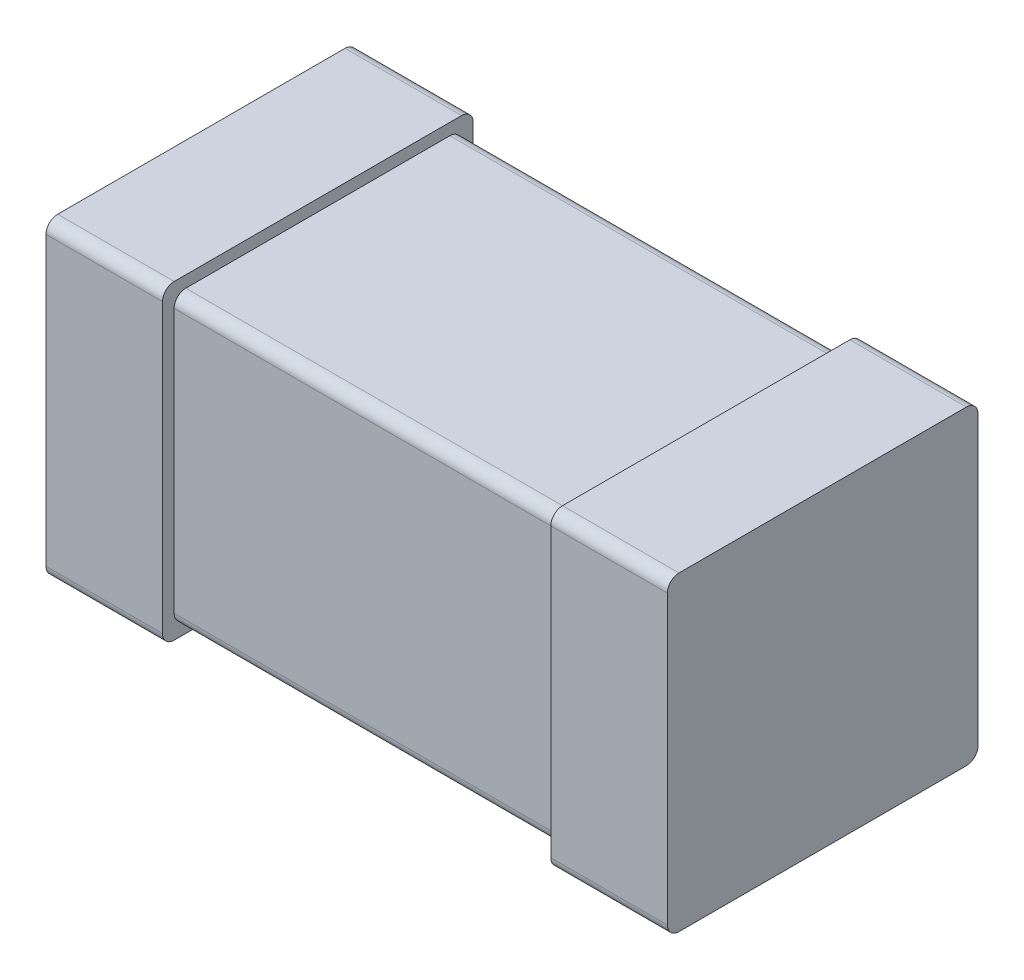
ISO-10303-21;
HEADER;
FILE_DESCRIPTION(('STEP AP214'),'2;1');
FILE_NAME('part.step','',(''),(''),'','','');
FILE_SCHEMA(('AUTOMOTIVE_DESIGN { 1 0 10303 214 1 1 1 1 }'));
ENDSEC;
DATA;
#1=APPLICATION_CONTEXT('core data for automotive mechanical design processes');
#2=APPLICATION_PROTOCOL_DEFINITION('international standard','automotive_design',2000,#1);
#3=PRODUCT_CONTEXT('',#1,'mechanical');
#4=PRODUCT('Part','Part','',(#3));
#5=PRODUCT_RELATED_PRODUCT_CATEGORY('part','',(#4));
#6=PRODUCT_DEFINITION_FORMATION('','',#4);
#7=PRODUCT_DEFINITION_CONTEXT('part definition',#1,'design');
#8=PRODUCT_DEFINITION('design','',#6,#7);
#9=PRODUCT_DEFINITION_SHAPE('','',#8);
#10=(LENGTH_UNIT() NAMED_UNIT(*) SI_UNIT(.MILLI.,.METRE.));
#11=(NAMED_UNIT(*) PLANE_ANGLE_UNIT() SI_UNIT($,.RADIAN.));
#12=(NAMED_UNIT(*) SI_UNIT($,.STERADIAN.) SOLID_ANGLE_UNIT());
#13=UNCERTAINTY_MEASURE_WITH_UNIT(LENGTH_MEASURE(1.E-05),#10,'distance_accuracy_value','');
#14=(GEOMETRIC_REPRESENTATION_CONTEXT(3) GLOBAL_UNCERTAINTY_ASSIGNED_CONTEXT((#13)) GLOBAL_UNIT_ASSIGNED_CONTEXT((#10,
#11,#12)) REPRESENTATION_CONTEXT('',''));
#15=CARTESIAN_POINT('',(0.,0.,0.));
#16=DIRECTION('',(0.,0.,1.));
#17=DIRECTION('',(1.,0.,0.));
#18=AXIS2_PLACEMENT_3D('',#15,#16,#17);
#19=CARTESIAN_POINT('',(-0.8,0.4,0.));
#20=DIRECTION('',(1.,0.,0.));
#21=DIRECTION('',(0.,0.,1.));
#22=AXIS2_PLACEMENT_3D('',#19,#20,#21);
#23=PLANE('',#22);
#24=DIRECTION('',(0.,-1.,0.));
#25=VECTOR('',#24,1.);
#26=CARTESIAN_POINT('',(-0.8,0.,0.8));
#27=LINE('',#26,#25);
#28=CARTESIAN_POINT('',(-0.8,0.37,0.8));
#29=VERTEX_POINT('',#28);
#30=CARTESIAN_POINT('',(-0.8,-0.37,0.8));
#31=VERTEX_POINT('',#30);
#32=EDGE_CURVE('E301',#29,#31,#27,.T.);
#33=ORIENTED_EDGE('',*,*,#32,.F.);
#34=CARTESIAN_POINT('',(-0.8,0.37,0.77));
#35=DIRECTION('',(1.,0.,0.));
#36=DIRECTION('',(0.,0.,-1.));
#37=AXIS2_PLACEMENT_3D('',#34,#35,#36);
#38=CIRCLE('',#37,0.0300000000000011);
#39=CARTESIAN_POINT('',(-0.8,0.4,0.77));
#40=VERTEX_POINT('',#39);
#41=EDGE_CURVE('E280',#40,#29,#38,.T.);
#42=ORIENTED_EDGE('',*,*,#41,.F.);
#43=DIRECTION('',(0.,0.,1.));
#44=VECTOR('',#43,1.);
#45=CARTESIAN_POINT('',(-0.8,0.4,0.4));
#46=LINE('',#45,#44);
#47=CARTESIAN_POINT('',(-0.8,0.4,0.03));
#48=VERTEX_POINT('',#47);
#49=EDGE_CURVE('E202',#48,#40,#46,.T.);
#50=ORIENTED_EDGE('',*,*,#49,.F.);
#51=CARTESIAN_POINT('',(-0.8,0.37,0.03));
#52=DIRECTION('',(1.,0.,0.));
#53=DIRECTION('',(0.,0.,-1.));
#54=AXIS2_PLACEMENT_3D('',#51,#52,#53);
#55=CIRCLE('',#54,0.0300000000000011);
#56=CARTESIAN_POINT('',(-0.8,0.37,0.));
#57=VERTEX_POINT('',#56);
#58=EDGE_CURVE('E197',#57,#48,#55,.T.);
#59=ORIENTED_EDGE('',*,*,#58,.F.);
#60=DIRECTION('',(0.,-1.,0.));
#61=VECTOR('',#60,1.);
#62=CARTESIAN_POINT('',(-0.8,0.,0.));
#63=LINE('',#62,#61);
#64=CARTESIAN_POINT('',(-0.8,-0.37,0.));
#65=VERTEX_POINT('',#64);
#66=EDGE_CURVE('E189',#57,#65,#63,.T.);
#67=ORIENTED_EDGE('',*,*,#66,.T.);
#68=CARTESIAN_POINT('',(-0.8,-0.37,0.03));
#69=DIRECTION('',(1.,0.,0.));
#70=DIRECTION('',(0.,0.,-1.));
#71=AXIS2_PLACEMENT_3D('',#68,#69,#70);
#72=CIRCLE('',#71,0.0300000000000011);
#73=CARTESIAN_POINT('',(-0.8,-0.4,0.03));
#74=VERTEX_POINT('',#73);
#75=EDGE_CURVE('E21',#74,#65,#72,.T.);
#76=ORIENTED_EDGE('',*,*,#75,.F.);
#77=DIRECTION('',(0.,0.,1.));
#78=VECTOR('',#77,1.);
#79=CARTESIAN_POINT('',(-0.8,-0.4,0.4));
#80=LINE('',#79,#78);
#81=CARTESIAN_POINT('',(-0.8,-0.4,0.77));
#82=VERTEX_POINT('',#81);
#83=EDGE_CURVE('E172',#74,#82,#80,.T.);
#84=ORIENTED_EDGE('',*,*,#83,.T.);
#85=CARTESIAN_POINT('',(-0.8,-0.37,0.77));
#86=DIRECTION('',(1.,0.,0.));
#87=DIRECTION('',(0.,0.,-1.));
#88=AXIS2_PLACEMENT_3D('',#85,#86,#87);
#89=CIRCLE('',#88,0.0300000000000011);
#90=EDGE_CURVE('E276',#31,#82,#89,.T.);
#91=ORIENTED_EDGE('',*,*,#90,.F.);
#92=EDGE_LOOP('',(#33,#42,#50,#59,#67,#76,#84,#91));
#93=FACE_BOUND('',#92,.T.);
#94=ADVANCED_FACE('F17',(#93),#23,.F.);
#95=CARTESIAN_POINT('',(0.8,0.4,0.));
#96=DIRECTION('',(1.,0.,0.));
#97=DIRECTION('',(0.,0.,1.));
#98=AXIS2_PLACEMENT_3D('',#95,#96,#97);
#99=PLANE('',#98);
#100=DIRECTION('',(0.,1.,0.));
#101=VECTOR('',#100,1.);
#102=CARTESIAN_POINT('',(0.8,0.,0.8));
#103=LINE('',#102,#101);
#104=CARTESIAN_POINT('',(0.8,-0.37,0.8));
#105=VERTEX_POINT('',#104);
#106=CARTESIAN_POINT('',(0.8,0.37,0.8));
#107=VERTEX_POINT('',#106);
#108=EDGE_CURVE('E291',#105,#107,#103,.T.);
#109=ORIENTED_EDGE('',*,*,#108,.F.);
#110=CARTESIAN_POINT('',(0.8,-0.37,0.77));
#111=DIRECTION('',(1.,0.,0.));
#112=DIRECTION('',(0.,0.,-1.));
#113=AXIS2_PLACEMENT_3D('',#110,#111,#112);
#114=CIRCLE('',#113,0.0300000000000011);
#115=CARTESIAN_POINT('',(0.8,-0.4,0.77));
#116=VERTEX_POINT('',#115);
#117=EDGE_CURVE('E260',#116,#105,#114,.F.);
#118=ORIENTED_EDGE('',*,*,#117,.F.);
#119=DIRECTION('',(0.,0.,-1.));
#120=VECTOR('',#119,1.);
#121=CARTESIAN_POINT('',(0.8,-0.4,0.4));
#122=LINE('',#121,#120);
#123=CARTESIAN_POINT('',(0.8,-0.4,0.03));
#124=VERTEX_POINT('',#123);
#125=EDGE_CURVE('E275',#116,#124,#122,.T.);
#126=ORIENTED_EDGE('',*,*,#125,.T.);
#127=CARTESIAN_POINT('',(0.8,-0.37,0.03));
#128=DIRECTION('',(1.,0.,0.));
#129=DIRECTION('',(0.,0.,-1.));
#130=AXIS2_PLACEMENT_3D('',#127,#128,#129);
#131=CIRCLE('',#130,0.0300000000000011);
#132=CARTESIAN_POINT('',(0.8,-0.37,0.));
#133=VERTEX_POINT('',#132);
#134=EDGE_CURVE('E272',#133,#124,#131,.F.);
#135=ORIENTED_EDGE('',*,*,#134,.F.);
#136=DIRECTION('',(0.,1.,0.));
#137=VECTOR('',#136,1.);
#138=CARTESIAN_POINT('',(0.8,0.,0.));
#139=LINE('',#138,#137);
#140=CARTESIAN_POINT('',(0.8,0.37,0.));
#141=VERTEX_POINT('',#140);
#142=EDGE_CURVE('E271',#133,#141,#139,.T.);
#143=ORIENTED_EDGE('',*,*,#142,.T.);
#144=CARTESIAN_POINT('',(0.8,0.37,0.03));
#145=DIRECTION('',(1.,0.,0.));
#146=DIRECTION('',(0.,0.,-1.));
#147=AXIS2_PLACEMENT_3D('',#144,#145,#146);
#148=CIRCLE('',#147,0.0300000000000011);
#149=CARTESIAN_POINT('',(0.8,0.4,0.03));
#150=VERTEX_POINT('',#149);
#151=EDGE_CURVE('E268',#150,#141,#148,.F.);
#152=ORIENTED_EDGE('',*,*,#151,.F.);
#153=DIRECTION('',(0.,0.,-1.));
#154=VECTOR('',#153,1.);
#155=CARTESIAN_POINT('',(0.8,0.4,0.4));
#156=LINE('',#155,#154);
#157=CARTESIAN_POINT('',(0.8,0.4,0.77));
#158=VERTEX_POINT('',#157);
#159=EDGE_CURVE('E296',#158,#150,#156,.T.);
#160=ORIENTED_EDGE('',*,*,#159,.F.);
#161=CARTESIAN_POINT('',(0.8,0.37,0.77));
#162=DIRECTION('',(1.,0.,0.));
#163=DIRECTION('',(0.,0.,-1.));
#164=AXIS2_PLACEMENT_3D('',#161,#162,#163);
#165=CIRCLE('',#164,0.0300000000000011);
#166=EDGE_CURVE('E264',#107,#158,#165,.F.);
#167=ORIENTED_EDGE('',*,*,#166,.F.);
#168=EDGE_LOOP('',(#109,#118,#126,#135,#143,#152,#160,#167));
#169=FACE_BOUND('',#168,.T.);
#170=ADVANCED_FACE('F444',(#169),#99,.T.);
#171=CARTESIAN_POINT('',(-0.8,-0.4,0.03));
#172=DIRECTION('',(0.,1.,0.));
#173=DIRECTION('',(0.,0.,1.));
#174=AXIS2_PLACEMENT_3D('',#171,#172,#173);
#175=PLANE('',#174);
#176=ORIENTED_EDGE('',*,*,#83,.F.);
#177=DIRECTION('',(-1.,0.,0.));
#178=VECTOR('',#177,1.);
#179=CARTESIAN_POINT('',(-0.65,-0.4,0.03));
#180=LINE('',#179,#178);
#181=CARTESIAN_POINT('',(-0.5,-0.4,0.03));
#182=VERTEX_POINT('',#181);
#183=EDGE_CURVE('E183',#182,#74,#180,.T.);
#184=ORIENTED_EDGE('',*,*,#183,.F.);
#185=DIRECTION('',(0.,0.,-1.));
#186=VECTOR('',#185,1.);
#187=CARTESIAN_POINT('',(-0.5,-0.4,0.4));
#188=LINE('',#187,#186);
#189=CARTESIAN_POINT('',(-0.5,-0.4,0.77));
#190=VERTEX_POINT('',#189);
#191=EDGE_CURVE('E259',#190,#182,#188,.T.);
#192=ORIENTED_EDGE('',*,*,#191,.F.);
#193=DIRECTION('',(1.,0.,0.));
#194=VECTOR('',#193,1.);
#195=CARTESIAN_POINT('',(-0.65,-0.4,0.77));
#196=LINE('',#195,#194);
#197=EDGE_CURVE('E308',#82,#190,#196,.T.);
#198=ORIENTED_EDGE('',*,*,#197,.F.);
#199=EDGE_LOOP('',(#176,#184,#192,#198));
#200=FACE_BOUND('',#199,.T.);
#201=ADVANCED_FACE('F311',(#200),#175,.F.);
#202=CARTESIAN_POINT('',(-0.8,-0.37,0.03));
#203=DIRECTION('',(1.,0.,0.));
#204=DIRECTION('',(0.,0.,-1.));
#205=AXIS2_PLACEMENT_3D('',#202,#203,#204);
#206=CYLINDRICAL_SURFACE('',#205,0.0300000000000011);
#207=CARTESIAN_POINT('',(-0.5,-0.37,0.03));
#208=DIRECTION('',(1.,0.,0.));
#209=DIRECTION('',(0.,0.,-1.));
#210=AXIS2_PLACEMENT_3D('',#207,#208,#209);
#211=CIRCLE('',#210,0.0300000000000011);
#212=CARTESIAN_POINT('',(-0.5,-0.37,0.));
#213=VERTEX_POINT('',#212);
#214=EDGE_CURVE('E257',#182,#213,#211,.T.);
#215=ORIENTED_EDGE('',*,*,#214,.F.);
#216=ORIENTED_EDGE('',*,*,#183,.T.);
#217=ORIENTED_EDGE('',*,*,#75,.T.);
#218=DIRECTION('',(1.,0.,0.));
#219=VECTOR('',#218,1.);
#220=CARTESIAN_POINT('',(-0.65,-0.37,0.));
#221=LINE('',#220,#219);
#222=EDGE_CURVE('E181',#65,#213,#221,.T.);
#223=ORIENTED_EDGE('',*,*,#222,.T.);
#224=EDGE_LOOP('',(#215,#216,#217,#223));
#225=FACE_BOUND('',#224,.T.);
#226=ADVANCED_FACE('F180',(#225),#206,.T.);
#227=CARTESIAN_POINT('',(-0.8,-0.37,0.));
#228=DIRECTION('',(0.,0.,1.));
#229=DIRECTION('',(1.,0.,0.));
#230=AXIS2_PLACEMENT_3D('',#227,#228,#229);
#231=PLANE('',#230);
#232=DIRECTION('',(0.,1.,0.));
#233=VECTOR('',#232,1.);
#234=CARTESIAN_POINT('',(-0.5,0.,0.));
#235=LINE('',#234,#233);
#236=CARTESIAN_POINT('',(-0.5,0.37,0.));
#237=VERTEX_POINT('',#236);
#238=EDGE_CURVE('E191',#213,#237,#235,.T.);
#239=ORIENTED_EDGE('',*,*,#238,.F.);
#240=ORIENTED_EDGE('',*,*,#222,.F.);
#241=ORIENTED_EDGE('',*,*,#66,.F.);
#242=DIRECTION('',(-1.,0.,0.));
#243=VECTOR('',#242,1.);
#244=CARTESIAN_POINT('',(-0.65,0.37,0.));
#245=LINE('',#244,#243);
#246=EDGE_CURVE('E192',#237,#57,#245,.T.);
#247=ORIENTED_EDGE('',*,*,#246,.F.);
#248=EDGE_LOOP('',(#239,#240,#241,#247));
#249=FACE_BOUND('',#248,.T.);
#250=ADVANCED_FACE('F187',(#249),#231,.F.);
#251=CARTESIAN_POINT('',(-0.8,0.37,0.03));
#252=DIRECTION('',(1.,0.,0.));
#253=DIRECTION('',(0.,0.,-1.));
#254=AXIS2_PLACEMENT_3D('',#251,#252,#253);
#255=CYLINDRICAL_SURFACE('',#254,0.0300000000000011);
#256=ORIENTED_EDGE('',*,*,#246,.T.);
#257=ORIENTED_EDGE('',*,*,#58,.T.);
#258=DIRECTION('',(-1.,0.,0.));
#259=VECTOR('',#258,1.);
#260=CARTESIAN_POINT('',(-0.65,0.4,0.03));
#261=LINE('',#260,#259);
#262=CARTESIAN_POINT('',(-0.5,0.4,0.03));
#263=VERTEX_POINT('',#262);
#264=EDGE_CURVE('E282',#263,#48,#261,.T.);
#265=ORIENTED_EDGE('',*,*,#264,.F.);
#266=CARTESIAN_POINT('',(-0.5,0.37,0.03));
#267=DIRECTION('',(1.,0.,0.));
#268=DIRECTION('',(0.,0.,-1.));
#269=AXIS2_PLACEMENT_3D('',#266,#267,#268);
#270=CIRCLE('',#269,0.0300000000000011);
#271=EDGE_CURVE('E255',#237,#263,#270,.T.);
#272=ORIENTED_EDGE('',*,*,#271,.F.);
#273=EDGE_LOOP('',(#256,#257,#265,#272));
#274=FACE_BOUND('',#273,.T.);
#275=ADVANCED_FACE('F670',(#274),#255,.T.);
#276=CARTESIAN_POINT('',(-0.8,0.4,0.03));
#277=DIRECTION('',(0.,1.,0.));
#278=DIRECTION('',(0.,0.,1.));
#279=AXIS2_PLACEMENT_3D('',#276,#277,#278);
#280=PLANE('',#279);
#281=ORIENTED_EDGE('',*,*,#49,.T.);
#282=DIRECTION('',(-1.,0.,0.));
#283=VECTOR('',#282,1.);
#284=CARTESIAN_POINT('',(-0.65,0.4,0.77));
#285=LINE('',#284,#283);
#286=CARTESIAN_POINT('',(-0.5,0.4,0.77));
#287=VERTEX_POINT('',#286);
#288=EDGE_CURVE('E281',#287,#40,#285,.T.);
#289=ORIENTED_EDGE('',*,*,#288,.F.);
#290=DIRECTION('',(0.,0.,1.));
#291=VECTOR('',#290,1.);
#292=CARTESIAN_POINT('',(-0.5,0.4,0.4));
#293=LINE('',#292,#291);
#294=EDGE_CURVE('E254',#263,#287,#293,.T.);
#295=ORIENTED_EDGE('',*,*,#294,.F.);
#296=ORIENTED_EDGE('',*,*,#264,.T.);
#297=EDGE_LOOP('',(#281,#289,#295,#296));
#298=FACE_BOUND('',#297,.T.);
#299=ADVANCED_FACE('F662',(#298),#280,.T.);
#300=CARTESIAN_POINT('',(-0.8,0.37,0.77));
#301=DIRECTION('',(1.,0.,0.));
#302=DIRECTION('',(0.,0.,-1.));
#303=AXIS2_PLACEMENT_3D('',#300,#301,#302);
#304=CYLINDRICAL_SURFACE('',#303,0.0300000000000011);
#305=CARTESIAN_POINT('',(-0.5,0.37,0.77));
#306=DIRECTION('',(1.,0.,0.));
#307=DIRECTION('',(0.,0.,-1.));
#308=AXIS2_PLACEMENT_3D('',#305,#306,#307);
#309=CIRCLE('',#308,0.0300000000000011);
#310=CARTESIAN_POINT('',(-0.5,0.37,0.8));
#311=VERTEX_POINT('',#310);
#312=EDGE_CURVE('E252',#287,#311,#309,.T.);
#313=ORIENTED_EDGE('',*,*,#312,.F.);
#314=ORIENTED_EDGE('',*,*,#288,.T.);
#315=ORIENTED_EDGE('',*,*,#41,.T.);
#316=DIRECTION('',(-1.,0.,0.));
#317=VECTOR('',#316,1.);
#318=CARTESIAN_POINT('',(-0.65,0.37,0.8));
#319=LINE('',#318,#317);
#320=EDGE_CURVE('E302',#311,#29,#319,.T.);
#321=ORIENTED_EDGE('',*,*,#320,.F.);
#322=EDGE_LOOP('',(#313,#314,#315,#321));
#323=FACE_BOUND('',#322,.T.);
#324=ADVANCED_FACE('F323',(#323),#304,.T.);
#325=CARTESIAN_POINT('',(-0.8,-0.37,0.8));
#326=DIRECTION('',(0.,0.,1.));
#327=DIRECTION('',(1.,0.,0.));
#328=AXIS2_PLACEMENT_3D('',#325,#326,#327);
#329=PLANE('',#328);
#330=DIRECTION('',(0.,-1.,0.));
#331=VECTOR('',#330,1.);
#332=CARTESIAN_POINT('',(-0.5,0.,0.8));
#333=LINE('',#332,#331);
#334=CARTESIAN_POINT('',(-0.5,-0.37,0.8));
#335=VERTEX_POINT('',#334);
#336=EDGE_CURVE('E251',#311,#335,#333,.T.);
#337=ORIENTED_EDGE('',*,*,#336,.F.);
#338=ORIENTED_EDGE('',*,*,#320,.T.);
#339=ORIENTED_EDGE('',*,*,#32,.T.);
#340=DIRECTION('',(-1.,0.,0.));
#341=VECTOR('',#340,1.);
#342=CARTESIAN_POINT('',(-0.65,-0.37,0.8));
#343=LINE('',#342,#341);
#344=EDGE_CURVE('E279',#335,#31,#343,.T.);
#345=ORIENTED_EDGE('',*,*,#344,.F.);
#346=EDGE_LOOP('',(#337,#338,#339,#345));
#347=FACE_BOUND('',#346,.T.);
#348=ADVANCED_FACE('F329',(#347),#329,.T.);
#349=CARTESIAN_POINT('',(-0.8,-0.37,0.77));
#350=DIRECTION('',(1.,0.,0.));
#351=DIRECTION('',(0.,0.,-1.));
#352=AXIS2_PLACEMENT_3D('',#349,#350,#351);
#353=CYLINDRICAL_SURFACE('',#352,0.0300000000000011);
#354=ORIENTED_EDGE('',*,*,#344,.T.);
#355=ORIENTED_EDGE('',*,*,#90,.T.);
#356=ORIENTED_EDGE('',*,*,#197,.T.);
#357=CARTESIAN_POINT('',(-0.5,-0.37,0.77));
#358=DIRECTION('',(1.,0.,0.));
#359=DIRECTION('',(0.,0.,-1.));
#360=AXIS2_PLACEMENT_3D('',#357,#358,#359);
#361=CIRCLE('',#360,0.0300000000000011);
#362=EDGE_CURVE('E248',#335,#190,#361,.T.);
#363=ORIENTED_EDGE('',*,*,#362,.F.);
#364=EDGE_LOOP('',(#354,#355,#356,#363));
#365=FACE_BOUND('',#364,.T.);
#366=ADVANCED_FACE('F306',(#365),#353,.T.);
#367=CARTESIAN_POINT('',(0.5,-0.4,0.03));
#368=DIRECTION('',(0.,1.,0.));
#369=DIRECTION('',(0.,0.,1.));
#370=AXIS2_PLACEMENT_3D('',#367,#368,#369);
#371=PLANE('',#370);
#372=DIRECTION('',(0.,0.,-1.));
#373=VECTOR('',#372,1.);
#374=CARTESIAN_POINT('',(0.5,-0.4,0.4));
#375=LINE('',#374,#373);
#376=CARTESIAN_POINT('',(0.5,-0.4,0.77));
#377=VERTEX_POINT('',#376);
#378=CARTESIAN_POINT('',(0.5,-0.4,0.03));
#379=VERTEX_POINT('',#378);
#380=EDGE_CURVE('E237',#377,#379,#375,.T.);
#381=ORIENTED_EDGE('',*,*,#380,.T.);
#382=DIRECTION('',(-1.,0.,0.));
#383=VECTOR('',#382,1.);
#384=CARTESIAN_POINT('',(0.65,-0.4,0.03));
#385=LINE('',#384,#383);
#386=EDGE_CURVE('E274',#124,#379,#385,.T.);
#387=ORIENTED_EDGE('',*,*,#386,.F.);
#388=ORIENTED_EDGE('',*,*,#125,.F.);
#389=DIRECTION('',(1.,0.,0.));
#390=VECTOR('',#389,1.);
#391=CARTESIAN_POINT('',(0.65,-0.4,0.77));
#392=LINE('',#391,#390);
#393=EDGE_CURVE('E263',#377,#116,#392,.T.);
#394=ORIENTED_EDGE('',*,*,#393,.F.);
#395=EDGE_LOOP('',(#381,#387,#388,#394));
#396=FACE_BOUND('',#395,.T.);
#397=ADVANCED_FACE('F370',(#396),#371,.F.);
#398=CARTESIAN_POINT('',(0.5,-0.37,0.03));
#399=DIRECTION('',(1.,0.,0.));
#400=DIRECTION('',(0.,0.,-1.));
#401=AXIS2_PLACEMENT_3D('',#398,#399,#400);
#402=CYLINDRICAL_SURFACE('',#401,0.0300000000000011);
#403=ORIENTED_EDGE('',*,*,#134,.T.);
#404=ORIENTED_EDGE('',*,*,#386,.T.);
#405=CARTESIAN_POINT('',(0.5,-0.37,0.03));
#406=DIRECTION('',(1.,0.,0.));
#407=DIRECTION('',(0.,0.,-1.));
#408=AXIS2_PLACEMENT_3D('',#405,#406,#407);
#409=CIRCLE('',#408,0.0300000000000011);
#410=CARTESIAN_POINT('',(0.5,-0.37,0.));
#411=VERTEX_POINT('',#410);
#412=EDGE_CURVE('E234',#379,#411,#409,.T.);
#413=ORIENTED_EDGE('',*,*,#412,.T.);
#414=DIRECTION('',(1.,0.,0.));
#415=VECTOR('',#414,1.);
#416=CARTESIAN_POINT('',(0.65,-0.37,0.));
#417=LINE('',#416,#415);
#418=EDGE_CURVE('E300',#411,#133,#417,.T.);
#419=ORIENTED_EDGE('',*,*,#418,.T.);
#420=EDGE_LOOP('',(#403,#404,#413,#419));
#421=FACE_BOUND('',#420,.T.);
#422=ADVANCED_FACE('F359',(#421),#402,.T.);
#423=CARTESIAN_POINT('',(0.5,-0.37,0.));
#424=DIRECTION('',(0.,0.,1.));
#425=DIRECTION('',(1.,0.,0.));
#426=AXIS2_PLACEMENT_3D('',#423,#424,#425);
#427=PLANE('',#426);
#428=ORIENTED_EDGE('',*,*,#142,.F.);
#429=ORIENTED_EDGE('',*,*,#418,.F.);
#430=DIRECTION('',(0.,1.,0.));
#431=VECTOR('',#430,1.);
#432=CARTESIAN_POINT('',(0.5,0.,0.));
#433=LINE('',#432,#431);
#434=CARTESIAN_POINT('',(0.5,0.37,0.));
#435=VERTEX_POINT('',#434);
#436=EDGE_CURVE('E233',#411,#435,#433,.T.);
#437=ORIENTED_EDGE('',*,*,#436,.T.);
#438=DIRECTION('',(-1.,0.,0.));
#439=VECTOR('',#438,1.);
#440=CARTESIAN_POINT('',(0.65,0.37,0.));
#441=LINE('',#440,#439);
#442=EDGE_CURVE('E270',#141,#435,#441,.T.);
#443=ORIENTED_EDGE('',*,*,#442,.F.);
#444=EDGE_LOOP('',(#428,#429,#437,#443));
#445=FACE_BOUND('',#444,.T.);
#446=ADVANCED_FACE('F441',(#445),#427,.F.);
#447=CARTESIAN_POINT('',(0.5,0.37,0.03));
#448=DIRECTION('',(1.,0.,0.));
#449=DIRECTION('',(0.,0.,-1.));
#450=AXIS2_PLACEMENT_3D('',#447,#448,#449);
#451=CYLINDRICAL_SURFACE('',#450,0.0300000000000011);
#452=ORIENTED_EDGE('',*,*,#442,.T.);
#453=CARTESIAN_POINT('',(0.5,0.37,0.03));
#454=DIRECTION('',(1.,0.,0.));
#455=DIRECTION('',(0.,0.,-1.));
#456=AXIS2_PLACEMENT_3D('',#453,#454,#455);
#457=CIRCLE('',#456,0.0300000000000011);
#458=CARTESIAN_POINT('',(0.5,0.4,0.03));
#459=VERTEX_POINT('',#458);
#460=EDGE_CURVE('E230',#435,#459,#457,.T.);
#461=ORIENTED_EDGE('',*,*,#460,.T.);
#462=DIRECTION('',(-1.,0.,0.));
#463=VECTOR('',#462,1.);
#464=CARTESIAN_POINT('',(0.65,0.4,0.03));
#465=LINE('',#464,#463);
#466=EDGE_CURVE('E267',#150,#459,#465,.T.);
#467=ORIENTED_EDGE('',*,*,#466,.F.);
#468=ORIENTED_EDGE('',*,*,#151,.T.);
#469=EDGE_LOOP('',(#452,#461,#467,#468));
#470=FACE_BOUND('',#469,.T.);
#471=ADVANCED_FACE('F436',(#470),#451,.T.);
#472=CARTESIAN_POINT('',(0.5,0.4,0.03));
#473=DIRECTION('',(0.,1.,0.));
#474=DIRECTION('',(0.,0.,1.));
#475=AXIS2_PLACEMENT_3D('',#472,#473,#474);
#476=PLANE('',#475);
#477=DIRECTION('',(0.,0.,1.));
#478=VECTOR('',#477,1.);
#479=CARTESIAN_POINT('',(0.5,0.4,0.4));
#480=LINE('',#479,#478);
#481=CARTESIAN_POINT('',(0.5,0.4,0.77));
#482=VERTEX_POINT('',#481);
#483=EDGE_CURVE('E229',#459,#482,#480,.T.);
#484=ORIENTED_EDGE('',*,*,#483,.T.);
#485=DIRECTION('',(-1.,0.,0.));
#486=VECTOR('',#485,1.);
#487=CARTESIAN_POINT('',(0.65,0.4,0.77));
#488=LINE('',#487,#486);
#489=EDGE_CURVE('E266',#158,#482,#488,.T.);
#490=ORIENTED_EDGE('',*,*,#489,.F.);
#491=ORIENTED_EDGE('',*,*,#159,.T.);
#492=ORIENTED_EDGE('',*,*,#466,.T.);
#493=EDGE_LOOP('',(#484,#490,#491,#492));
#494=FACE_BOUND('',#493,.T.);
#495=ADVANCED_FACE('F432',(#494),#476,.T.);
#496=CARTESIAN_POINT('',(0.5,0.37,0.77));
#497=DIRECTION('',(1.,0.,0.));
#498=DIRECTION('',(0.,0.,-1.));
#499=AXIS2_PLACEMENT_3D('',#496,#497,#498);
#500=CYLINDRICAL_SURFACE('',#499,0.0300000000000011);
#501=ORIENTED_EDGE('',*,*,#166,.T.);
#502=ORIENTED_EDGE('',*,*,#489,.T.);
#503=CARTESIAN_POINT('',(0.5,0.37,0.77));
#504=DIRECTION('',(1.,0.,0.));
#505=DIRECTION('',(0.,0.,-1.));
#506=AXIS2_PLACEMENT_3D('',#503,#504,#505);
#507=CIRCLE('',#506,0.0300000000000011);
#508=CARTESIAN_POINT('',(0.5,0.37,0.8));
#509=VERTEX_POINT('',#508);
#510=EDGE_CURVE('E226',#482,#509,#507,.T.);
#511=ORIENTED_EDGE('',*,*,#510,.T.);
#512=DIRECTION('',(-1.,0.,0.));
#513=VECTOR('',#512,1.);
#514=CARTESIAN_POINT('',(0.65,0.37,0.8));
#515=LINE('',#514,#513);
#516=EDGE_CURVE('E293',#107,#509,#515,.T.);
#517=ORIENTED_EDGE('',*,*,#516,.F.);
#518=EDGE_LOOP('',(#501,#502,#511,#517));
#519=FACE_BOUND('',#518,.T.);
#520=ADVANCED_FACE('F455',(#519),#500,.T.);
#521=CARTESIAN_POINT('',(0.5,-0.37,0.8));
#522=DIRECTION('',(0.,0.,1.));
#523=DIRECTION('',(1.,0.,0.));
#524=AXIS2_PLACEMENT_3D('',#521,#522,#523);
#525=PLANE('',#524);
#526=ORIENTED_EDGE('',*,*,#108,.T.);
#527=ORIENTED_EDGE('',*,*,#516,.T.);
#528=DIRECTION('',(0.,-1.,0.));
#529=VECTOR('',#528,1.);
#530=CARTESIAN_POINT('',(0.5,0.,0.8));
#531=LINE('',#530,#529);
#532=CARTESIAN_POINT('',(0.5,-0.37,0.8));
#533=VERTEX_POINT('',#532);
#534=EDGE_CURVE('E225',#509,#533,#531,.T.);
#535=ORIENTED_EDGE('',*,*,#534,.T.);
#536=DIRECTION('',(-1.,0.,0.));
#537=VECTOR('',#536,1.);
#538=CARTESIAN_POINT('',(0.65,-0.37,0.8));
#539=LINE('',#538,#537);
#540=EDGE_CURVE('E262',#105,#533,#539,.T.);
#541=ORIENTED_EDGE('',*,*,#540,.F.);
#542=EDGE_LOOP('',(#526,#527,#535,#541));
#543=FACE_BOUND('',#542,.T.);
#544=ADVANCED_FACE('F451',(#543),#525,.T.);
#545=CARTESIAN_POINT('',(0.5,-0.37,0.77));
#546=DIRECTION('',(1.,0.,0.));
#547=DIRECTION('',(0.,0.,-1.));
#548=AXIS2_PLACEMENT_3D('',#545,#546,#547);
#549=CYLINDRICAL_SURFACE('',#548,0.0300000000000011);
#550=ORIENTED_EDGE('',*,*,#540,.T.);
#551=CARTESIAN_POINT('',(0.5,-0.37,0.77));
#552=DIRECTION('',(1.,0.,0.));
#553=DIRECTION('',(0.,0.,-1.));
#554=AXIS2_PLACEMENT_3D('',#551,#552,#553);
#555=CIRCLE('',#554,0.0300000000000011);
#556=EDGE_CURVE('E222',#533,#377,#555,.T.);
#557=ORIENTED_EDGE('',*,*,#556,.T.);
#558=ORIENTED_EDGE('',*,*,#393,.T.);
#559=ORIENTED_EDGE('',*,*,#117,.T.);
#560=EDGE_LOOP('',(#550,#557,#558,#559));
#561=FACE_BOUND('',#560,.T.);
#562=ADVANCED_FACE('F448',(#561),#549,.T.);
#563=CARTESIAN_POINT('',(-0.5,-0.37,0.06));
#564=DIRECTION('',(0.,1.,0.));
#565=DIRECTION('',(0.,0.,1.));
#566=AXIS2_PLACEMENT_3D('',#563,#564,#565);
#567=PLANE('',#566);
#568=DIRECTION('',(0.,0.,1.));
#569=VECTOR('',#568,1.);
#570=CARTESIAN_POINT('',(-0.5,-0.37,0.4));
#571=LINE('',#570,#569);
#572=CARTESIAN_POINT('',(-0.5,-0.37,0.06));
#573=VERTEX_POINT('',#572);
#574=CARTESIAN_POINT('',(-0.5,-0.37,0.74));
#575=VERTEX_POINT('',#574);
#576=EDGE_CURVE('E247',#573,#575,#571,.T.);
#577=ORIENTED_EDGE('',*,*,#576,.F.);
#578=DIRECTION('',(-1.,0.,0.));
#579=VECTOR('',#578,1.);
#580=CARTESIAN_POINT('',(0.,-0.37,0.06));
#581=LINE('',#580,#579);
#582=CARTESIAN_POINT('',(0.5,-0.37,0.06));
#583=VERTEX_POINT('',#582);
#584=EDGE_CURVE('E240',#583,#573,#581,.T.);
#585=ORIENTED_EDGE('',*,*,#584,.F.);
#586=DIRECTION('',(0.,0.,1.));
#587=VECTOR('',#586,1.);
#588=CARTESIAN_POINT('',(0.5,-0.37,0.4));
#589=LINE('',#588,#587);
#590=CARTESIAN_POINT('',(0.5,-0.37,0.74));
#591=VERTEX_POINT('',#590);
#592=EDGE_CURVE('E218',#583,#591,#589,.T.);
#593=ORIENTED_EDGE('',*,*,#592,.T.);
#594=DIRECTION('',(1.,0.,0.));
#595=VECTOR('',#594,1.);
#596=CARTESIAN_POINT('',(0.,-0.37,0.74));
#597=LINE('',#596,#595);
#598=EDGE_CURVE('E345',#575,#591,#597,.T.);
#599=ORIENTED_EDGE('',*,*,#598,.F.);
#600=EDGE_LOOP('',(#577,#585,#593,#599));
#601=FACE_BOUND('',#600,.T.);
#602=ADVANCED_FACE('F420',(#601),#567,.F.);
#603=CARTESIAN_POINT('',(-0.5,-0.34,0.74));
#604=DIRECTION('',(1.,0.,0.));
#605=DIRECTION('',(0.,0.,-1.));
#606=AXIS2_PLACEMENT_3D('',#603,#604,#605);
#607=CYLINDRICAL_SURFACE('',#606,0.0300000000000011);
#608=DIRECTION('',(1.,0.,0.));
#609=VECTOR('',#608,1.);
#610=CARTESIAN_POINT('',(0.,-0.34,0.77));
#611=LINE('',#610,#609);
#612=CARTESIAN_POINT('',(-0.5,-0.34,0.77));
#613=VERTEX_POINT('',#612);
#614=CARTESIAN_POINT('',(0.5,-0.34,0.77));
#615=VERTEX_POINT('',#614);
#616=EDGE_CURVE('E343',#613,#615,#611,.T.);
#617=ORIENTED_EDGE('',*,*,#616,.F.);
#618=CARTESIAN_POINT('',(-0.5,-0.34,0.74));
#619=DIRECTION('',(1.,0.,0.));
#620=DIRECTION('',(0.,0.,-1.));
#621=AXIS2_PLACEMENT_3D('',#618,#619,#620);
#622=CIRCLE('',#621,0.0300000000000011);
#623=EDGE_CURVE('E245',#575,#613,#622,.F.);
#624=ORIENTED_EDGE('',*,*,#623,.F.);
#625=ORIENTED_EDGE('',*,*,#598,.T.);
#626=CARTESIAN_POINT('',(0.5,-0.34,0.74));
#627=DIRECTION('',(1.,0.,0.));
#628=DIRECTION('',(0.,0.,-1.));
#629=AXIS2_PLACEMENT_3D('',#626,#627,#628);
#630=CIRCLE('',#629,0.0300000000000011);
#631=EDGE_CURVE('E215',#591,#615,#630,.F.);
#632=ORIENTED_EDGE('',*,*,#631,.T.);
#633=EDGE_LOOP('',(#617,#624,#625,#632));
#634=FACE_BOUND('',#633,.T.);
#635=ADVANCED_FACE('F422',(#634),#607,.T.);
#636=CARTESIAN_POINT('',(-0.5,-0.34,0.77));
#637=DIRECTION('',(0.,0.,1.));
#638=DIRECTION('',(1.,0.,0.));
#639=AXIS2_PLACEMENT_3D('',#636,#637,#638);
#640=PLANE('',#639);
#641=DIRECTION('',(0.,1.,0.));
#642=VECTOR('',#641,1.);
#643=CARTESIAN_POINT('',(0.5,0.,0.77));
#644=LINE('',#643,#642);
#645=CARTESIAN_POINT('',(0.5,0.34,0.77));
#646=VERTEX_POINT('',#645);
#647=EDGE_CURVE('E214',#615,#646,#644,.T.);
#648=ORIENTED_EDGE('',*,*,#647,.T.);
#649=DIRECTION('',(1.,0.,0.));
#650=VECTOR('',#649,1.);
#651=CARTESIAN_POINT('',(0.,0.34,0.77));
#652=LINE('',#651,#650);
#653=CARTESIAN_POINT('',(-0.5,0.34,0.77));
#654=VERTEX_POINT('',#653);
#655=EDGE_CURVE('E341',#654,#646,#652,.T.);
#656=ORIENTED_EDGE('',*,*,#655,.F.);
#657=DIRECTION('',(0.,1.,0.));
#658=VECTOR('',#657,1.);
#659=CARTESIAN_POINT('',(-0.5,0.,0.77));
#660=LINE('',#659,#658);
#661=EDGE_CURVE('E244',#613,#654,#660,.T.);
#662=ORIENTED_EDGE('',*,*,#661,.F.);
#663=ORIENTED_EDGE('',*,*,#616,.T.);
#664=EDGE_LOOP('',(#648,#656,#662,#663));
#665=FACE_BOUND('',#664,.T.);
#666=ADVANCED_FACE('F394',(#665),#640,.T.);
#667=CARTESIAN_POINT('',(-0.5,0.34,0.74));
#668=DIRECTION('',(1.,0.,0.));
#669=DIRECTION('',(0.,0.,-1.));
#670=AXIS2_PLACEMENT_3D('',#667,#668,#669);
#671=CYLINDRICAL_SURFACE('',#670,0.0300000000000011);
#672=CARTESIAN_POINT('',(0.5,0.34,0.74));
#673=DIRECTION('',(1.,0.,0.));
#674=DIRECTION('',(0.,0.,-1.));
#675=AXIS2_PLACEMENT_3D('',#672,#673,#674);
#676=CIRCLE('',#675,0.0300000000000011);
#677=CARTESIAN_POINT('',(0.5,0.37,0.74));
#678=VERTEX_POINT('',#677);
#679=EDGE_CURVE('E210',#646,#678,#676,.F.);
#680=ORIENTED_EDGE('',*,*,#679,.T.);
#681=DIRECTION('',(1.,0.,0.));
#682=VECTOR('',#681,1.);
#683=CARTESIAN_POINT('',(0.,0.37,0.74));
#684=LINE('',#683,#682);
#685=CARTESIAN_POINT('',(-0.5,0.37,0.74));
#686=VERTEX_POINT('',#685);
#687=EDGE_CURVE('E338',#686,#678,#684,.T.);
#688=ORIENTED_EDGE('',*,*,#687,.F.);
#689=CARTESIAN_POINT('',(-0.5,0.34,0.74));
#690=DIRECTION('',(1.,0.,0.));
#691=DIRECTION('',(0.,0.,-1.));
#692=AXIS2_PLACEMENT_3D('',#689,#690,#691);
#693=CIRCLE('',#692,0.0300000000000011);
#694=EDGE_CURVE('E242',#654,#686,#693,.F.);
#695=ORIENTED_EDGE('',*,*,#694,.F.);
#696=ORIENTED_EDGE('',*,*,#655,.T.);
#697=EDGE_LOOP('',(#680,#688,#695,#696));
#698=FACE_BOUND('',#697,.T.);
#699=ADVANCED_FACE('F398',(#698),#671,.T.);
#700=CARTESIAN_POINT('',(-0.5,0.37,0.06));
#701=DIRECTION('',(0.,1.,0.));
#702=DIRECTION('',(0.,0.,1.));
#703=AXIS2_PLACEMENT_3D('',#700,#701,#702);
#704=PLANE('',#703);
#705=DIRECTION('',(0.,0.,-1.));
#706=VECTOR('',#705,1.);
#707=CARTESIAN_POINT('',(-0.5,0.37,0.4));
#708=LINE('',#707,#706);
#709=CARTESIAN_POINT('',(-0.5,0.37,0.06));
#710=VERTEX_POINT('',#709);
#711=EDGE_CURVE('E241',#686,#710,#708,.T.);
#712=ORIENTED_EDGE('',*,*,#711,.F.);
#713=ORIENTED_EDGE('',*,*,#687,.T.);
#714=DIRECTION('',(0.,0.,-1.));
#715=VECTOR('',#714,1.);
#716=CARTESIAN_POINT('',(0.5,0.37,0.4));
#717=LINE('',#716,#715);
#718=CARTESIAN_POINT('',(0.5,0.37,0.06));
#719=VERTEX_POINT('',#718);
#720=EDGE_CURVE('E213',#678,#719,#717,.T.);
#721=ORIENTED_EDGE('',*,*,#720,.T.);
#722=DIRECTION('',(1.,0.,0.));
#723=VECTOR('',#722,1.);
#724=CARTESIAN_POINT('',(0.,0.37,0.06));
#725=LINE('',#724,#723);
#726=EDGE_CURVE('E209',#710,#719,#725,.T.);
#727=ORIENTED_EDGE('',*,*,#726,.F.);
#728=EDGE_LOOP('',(#712,#713,#721,#727));
#729=FACE_BOUND('',#728,.T.);
#730=ADVANCED_FACE('F404',(#729),#704,.T.);
#731=CARTESIAN_POINT('',(-0.5,0.4,0.));
#732=DIRECTION('',(1.,0.,0.));
#733=DIRECTION('',(0.,0.,1.));
#734=AXIS2_PLACEMENT_3D('',#731,#732,#733);
#735=PLANE('',#734);
#736=CARTESIAN_POINT('',(-0.5,0.34,0.0600000000000001));
#737=DIRECTION('',(1.,0.,0.));
#738=DIRECTION('',(0.,0.,-1.));
#739=AXIS2_PLACEMENT_3D('',#736,#737,#738);
#740=CIRCLE('',#739,0.0300000000000011);
#741=CARTESIAN_POINT('',(-0.5,0.34,0.03));
#742=VERTEX_POINT('',#741);
#743=EDGE_CURVE('E204',#742,#710,#740,.T.);
#744=ORIENTED_EDGE('',*,*,#743,.F.);
#745=DIRECTION('',(0.,-1.,0.));
#746=VECTOR('',#745,1.);
#747=CARTESIAN_POINT('',(-0.5,0.,0.03));
#748=LINE('',#747,#746);
#749=CARTESIAN_POINT('',(-0.5,-0.34,0.03));
#750=VERTEX_POINT('',#749);
#751=EDGE_CURVE('E207',#742,#750,#748,.T.);
#752=ORIENTED_EDGE('',*,*,#751,.T.);
#753=CARTESIAN_POINT('',(-0.5,-0.34,0.0600000000000001));
#754=DIRECTION('',(1.,0.,0.));
#755=DIRECTION('',(0.,0.,-1.));
#756=AXIS2_PLACEMENT_3D('',#753,#754,#755);
#757=CIRCLE('',#756,0.0300000000000011);
#758=EDGE_CURVE('E238',#573,#750,#757,.T.);
#759=ORIENTED_EDGE('',*,*,#758,.F.);
#760=ORIENTED_EDGE('',*,*,#576,.T.);
#761=ORIENTED_EDGE('',*,*,#623,.T.);
#762=ORIENTED_EDGE('',*,*,#661,.T.);
#763=ORIENTED_EDGE('',*,*,#694,.T.);
#764=ORIENTED_EDGE('',*,*,#711,.T.);
#765=EDGE_LOOP('',(#744,#752,#759,#760,#761,#762,#763,#764));
#766=FACE_BOUND('',#765,.T.);
#767=ORIENTED_EDGE('',*,*,#336,.T.);
#768=ORIENTED_EDGE('',*,*,#362,.T.);
#769=ORIENTED_EDGE('',*,*,#191,.T.);
#770=ORIENTED_EDGE('',*,*,#214,.T.);
#771=ORIENTED_EDGE('',*,*,#238,.T.);
#772=ORIENTED_EDGE('',*,*,#271,.T.);
#773=ORIENTED_EDGE('',*,*,#294,.T.);
#774=ORIENTED_EDGE('',*,*,#312,.T.);
#775=EDGE_LOOP('',(#767,#768,#769,#770,#771,#772,#773,#774));
#776=FACE_BOUND('',#775,.T.);
#777=ADVANCED_FACE('F387',(#766,#776),#735,.T.);
#778=CARTESIAN_POINT('',(-0.5,-0.34,0.0600000000000001));
#779=DIRECTION('',(1.,0.,0.));
#780=DIRECTION('',(0.,0.,-1.));
#781=AXIS2_PLACEMENT_3D('',#778,#779,#780);
#782=CYLINDRICAL_SURFACE('',#781,0.0300000000000011);
#783=CARTESIAN_POINT('',(0.5,-0.34,0.0600000000000001));
#784=DIRECTION('',(1.,0.,0.));
#785=DIRECTION('',(0.,0.,-1.));
#786=AXIS2_PLACEMENT_3D('',#783,#784,#785);
#787=CIRCLE('',#786,0.0300000000000011);
#788=CARTESIAN_POINT('',(0.5,-0.34,0.03));
#789=VERTEX_POINT('',#788);
#790=EDGE_CURVE('E219',#789,#583,#787,.F.);
#791=ORIENTED_EDGE('',*,*,#790,.T.);
#792=ORIENTED_EDGE('',*,*,#584,.T.);
#793=ORIENTED_EDGE('',*,*,#758,.T.);
#794=DIRECTION('',(1.,0.,0.));
#795=VECTOR('',#794,1.);
#796=CARTESIAN_POINT('',(0.,-0.34,0.03));
#797=LINE('',#796,#795);
#798=EDGE_CURVE('E375',#750,#789,#797,.T.);
#799=ORIENTED_EDGE('',*,*,#798,.T.);
#800=EDGE_LOOP('',(#791,#792,#793,#799));
#801=FACE_BOUND('',#800,.T.);
#802=ADVANCED_FACE('F416',(#801),#782,.T.);
#803=CARTESIAN_POINT('',(0.5,0.4,0.));
#804=DIRECTION('',(1.,0.,0.));
#805=DIRECTION('',(0.,0.,1.));
#806=AXIS2_PLACEMENT_3D('',#803,#804,#805);
#807=PLANE('',#806);
#808=CARTESIAN_POINT('',(0.5,0.34,0.0600000000000001));
#809=DIRECTION('',(1.,0.,0.));
#810=DIRECTION('',(0.,0.,-1.));
#811=AXIS2_PLACEMENT_3D('',#808,#809,#810);
#812=CIRCLE('',#811,0.0300000000000011);
#813=CARTESIAN_POINT('',(0.5,0.34,0.03));
#814=VERTEX_POINT('',#813);
#815=EDGE_CURVE('E35',#719,#814,#812,.F.);
#816=ORIENTED_EDGE('',*,*,#815,.F.);
#817=ORIENTED_EDGE('',*,*,#720,.F.);
#818=ORIENTED_EDGE('',*,*,#679,.F.);
#819=ORIENTED_EDGE('',*,*,#647,.F.);
#820=ORIENTED_EDGE('',*,*,#631,.F.);
#821=ORIENTED_EDGE('',*,*,#592,.F.);
#822=ORIENTED_EDGE('',*,*,#790,.F.);
#823=DIRECTION('',(0.,1.,0.));
#824=VECTOR('',#823,1.);
#825=CARTESIAN_POINT('',(0.5,0.,0.03));
#826=LINE('',#825,#824);
#827=EDGE_CURVE('E27',#789,#814,#826,.T.);
#828=ORIENTED_EDGE('',*,*,#827,.T.);
#829=EDGE_LOOP('',(#816,#817,#818,#819,#820,#821,#822,#828));
#830=FACE_BOUND('',#829,.T.);
#831=ORIENTED_EDGE('',*,*,#534,.F.);
#832=ORIENTED_EDGE('',*,*,#510,.F.);
#833=ORIENTED_EDGE('',*,*,#483,.F.);
#834=ORIENTED_EDGE('',*,*,#460,.F.);
#835=ORIENTED_EDGE('',*,*,#436,.F.);
#836=ORIENTED_EDGE('',*,*,#412,.F.);
#837=ORIENTED_EDGE('',*,*,#380,.F.);
#838=ORIENTED_EDGE('',*,*,#556,.F.);
#839=EDGE_LOOP('',(#831,#832,#833,#834,#835,#836,#837,#838));
#840=FACE_BOUND('',#839,.T.);
#841=ADVANCED_FACE('F365',(#830,#840),#807,.F.);
#842=CARTESIAN_POINT('',(-0.5,0.34,0.0600000000000001));
#843=DIRECTION('',(1.,0.,0.));
#844=DIRECTION('',(0.,0.,-1.));
#845=AXIS2_PLACEMENT_3D('',#842,#843,#844);
#846=CYLINDRICAL_SURFACE('',#845,0.0300000000000011);
#847=DIRECTION('',(-1.,0.,0.));
#848=VECTOR('',#847,1.);
#849=CARTESIAN_POINT('',(0.,0.34,0.03));
#850=LINE('',#849,#848);
#851=EDGE_CURVE('E11',#814,#742,#850,.T.);
#852=ORIENTED_EDGE('',*,*,#851,.T.);
#853=ORIENTED_EDGE('',*,*,#743,.T.);
#854=ORIENTED_EDGE('',*,*,#726,.T.);
#855=ORIENTED_EDGE('',*,*,#815,.T.);
#856=EDGE_LOOP('',(#852,#853,#854,#855));
#857=FACE_BOUND('',#856,.T.);
#858=ADVANCED_FACE('F405',(#857),#846,.T.);
#859=CARTESIAN_POINT('',(-0.5,-0.34,0.03));
#860=DIRECTION('',(0.,0.,1.));
#861=DIRECTION('',(1.,0.,0.));
#862=AXIS2_PLACEMENT_3D('',#859,#860,#861);
#863=PLANE('',#862);
#864=ORIENTED_EDGE('',*,*,#827,.F.);
#865=ORIENTED_EDGE('',*,*,#798,.F.);
#866=ORIENTED_EDGE('',*,*,#751,.F.);
#867=ORIENTED_EDGE('',*,*,#851,.F.);
#868=EDGE_LOOP('',(#864,#865,#866,#867));
#869=FACE_BOUND('',#868,.T.);
#870=ADVANCED_FACE('F19',(#869),#863,.F.);
#871=CLOSED_SHELL('',(#94,#170,#201,#226,#250,#275,#299,#324,#348,#366,#397,#422,#446,#471,#495,
#520,#544,#562,#602,#635,#666,#699,#730,#777,#802,#841,#858,#870));
#872=MANIFOLD_SOLID_BREP('B1',#871);
#873=ADVANCED_BREP_SHAPE_REPRESENTATION('',(#18,#872),#14);
#874=SHAPE_DEFINITION_REPRESENTATION(#9,#873);
ENDSEC;
END-ISO-10303-21;
